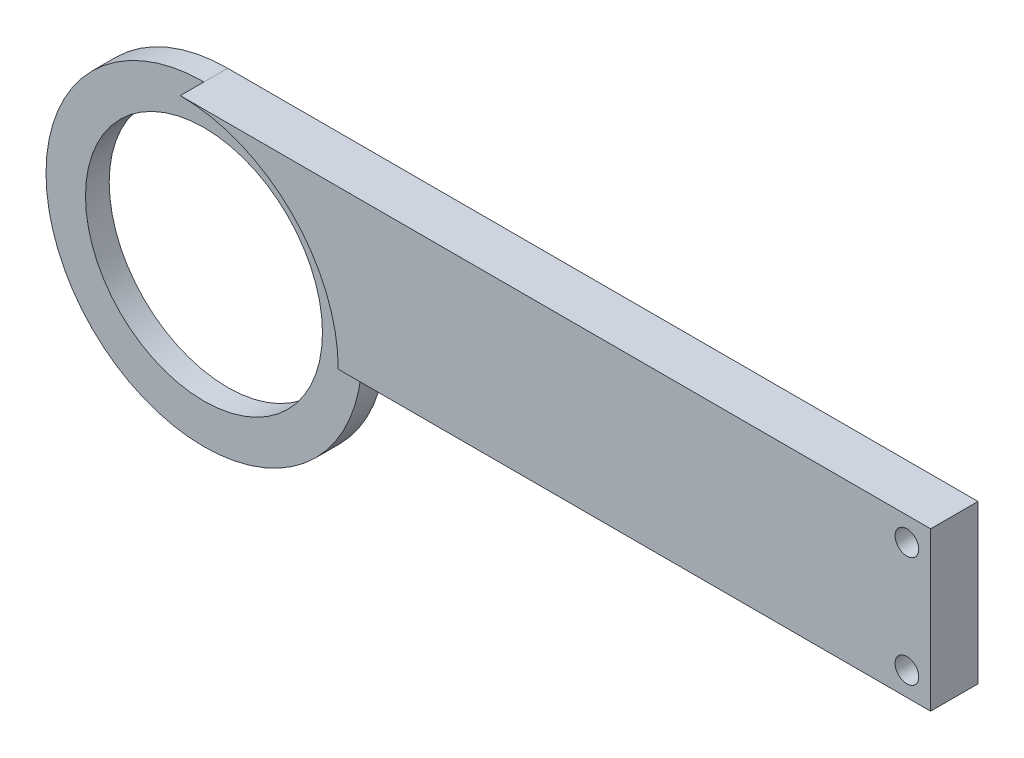
ISO-10303-21;
HEADER;
FILE_DESCRIPTION(('STEP AP214'),'2;1');
FILE_NAME('part.step','',(''),(''),'','','');
FILE_SCHEMA(('AUTOMOTIVE_DESIGN { 1 0 10303 214 1 1 1 1 }'));
ENDSEC;
DATA;
#1=APPLICATION_CONTEXT('core data for automotive mechanical design processes');
#2=APPLICATION_PROTOCOL_DEFINITION('international standard','automotive_design',2000,#1);
#3=PRODUCT_CONTEXT('',#1,'mechanical');
#4=PRODUCT('Part','Part','',(#3));
#5=PRODUCT_RELATED_PRODUCT_CATEGORY('part','',(#4));
#6=PRODUCT_DEFINITION_FORMATION('','',#4);
#7=PRODUCT_DEFINITION_CONTEXT('part definition',#1,'design');
#8=PRODUCT_DEFINITION('design','',#6,#7);
#9=PRODUCT_DEFINITION_SHAPE('','',#8);
#10=(LENGTH_UNIT() NAMED_UNIT(*) SI_UNIT(.MILLI.,.METRE.));
#11=(NAMED_UNIT(*) PLANE_ANGLE_UNIT() SI_UNIT($,.RADIAN.));
#12=(NAMED_UNIT(*) SI_UNIT($,.STERADIAN.) SOLID_ANGLE_UNIT());
#13=UNCERTAINTY_MEASURE_WITH_UNIT(LENGTH_MEASURE(1.E-05),#10,'distance_accuracy_value','');
#14=(GEOMETRIC_REPRESENTATION_CONTEXT(3) GLOBAL_UNCERTAINTY_ASSIGNED_CONTEXT((#13)) GLOBAL_UNIT_ASSIGNED_CONTEXT((#10,
#11,#12)) REPRESENTATION_CONTEXT('',''));
#15=CARTESIAN_POINT('',(0.,0.,0.));
#16=DIRECTION('',(0.,0.,1.));
#17=DIRECTION('',(1.,0.,0.));
#18=AXIS2_PLACEMENT_3D('',#15,#16,#17);
#19=CARTESIAN_POINT('',(-43.211335831246,3.7864077669903,6.));
#20=DIRECTION('',(0.,0.,-1.));
#21=DIRECTION('',(-1.,0.,0.));
#22=AXIS2_PLACEMENT_3D('',#19,#20,#21);
#23=CYLINDRICAL_SURFACE('',#22,20.);
#24=CARTESIAN_POINT('',(-43.211335831246,3.7864077669903,3.));
#25=DIRECTION('',(0.,0.,1.));
#26=DIRECTION('',(1.,0.,0.));
#27=AXIS2_PLACEMENT_3D('',#24,#25,#26);
#28=CIRCLE('',#27,20.);
#29=CARTESIAN_POINT('',(-43.211335831246,23.7864077669903,3.));
#30=VERTEX_POINT('',#29);
#31=CARTESIAN_POINT('',(-23.211335831246,3.7864077669903,3.));
#32=VERTEX_POINT('',#31);
#33=EDGE_CURVE('E127',#30,#32,#28,.T.);
#34=ORIENTED_EDGE('',*,*,#33,.F.);
#35=DIRECTION('',(0.,0.,-1.));
#36=VECTOR('',#35,1.);
#37=CARTESIAN_POINT('',(-43.211335831246,23.7864077669903,6.));
#38=LINE('',#37,#36);
#39=CARTESIAN_POINT('',(-43.211335831246,23.7864077669903,0.));
#40=VERTEX_POINT('',#39);
#41=EDGE_CURVE('E45',#30,#40,#38,.T.);
#42=ORIENTED_EDGE('',*,*,#41,.T.);
#43=CARTESIAN_POINT('',(-43.211335831246,3.7864077669903,0.));
#44=DIRECTION('',(0.,0.,1.));
#45=DIRECTION('',(1.,0.,0.));
#46=AXIS2_PLACEMENT_3D('',#43,#44,#45);
#47=CIRCLE('',#46,20.);
#48=CARTESIAN_POINT('',(-23.211335831246,3.7864077669903,0.));
#49=VERTEX_POINT('',#48);
#50=EDGE_CURVE('E99',#40,#49,#47,.T.);
#51=ORIENTED_EDGE('',*,*,#50,.T.);
#52=DIRECTION('',(0.,0.,-1.));
#53=VECTOR('',#52,1.);
#54=CARTESIAN_POINT('',(-23.211335831246,3.7864077669903,6.));
#55=LINE('',#54,#53);
#56=EDGE_CURVE('E95',#32,#49,#55,.T.);
#57=ORIENTED_EDGE('',*,*,#56,.F.);
#58=EDGE_LOOP('',(#34,#42,#51,#57));
#59=FACE_BOUND('',#58,.T.);
#60=ADVANCED_FACE('F36',(#59),#23,.T.);
#61=CARTESIAN_POINT('',(-43.211335831246,3.7864077669903,6.));
#62=DIRECTION('',(0.,0.,-1.));
#63=DIRECTION('',(-1.,0.,0.));
#64=AXIS2_PLACEMENT_3D('',#61,#62,#63);
#65=CYLINDRICAL_SURFACE('',#64,15.);
#66=CARTESIAN_POINT('',(-43.211335831246,3.7864077669903,0.));
#67=DIRECTION('',(0.,0.,1.));
#68=DIRECTION('',(1.,0.,0.));
#69=AXIS2_PLACEMENT_3D('',#66,#67,#68);
#70=CIRCLE('',#69,15.);
#71=CARTESIAN_POINT('',(-28.211335831246,3.7864077669903,0.));
#72=VERTEX_POINT('',#71);
#73=EDGE_CURVE('E126',#72,#72,#70,.T.);
#74=ORIENTED_EDGE('',*,*,#73,.F.);
#75=EDGE_LOOP('',(#74));
#76=FACE_BOUND('',#75,.T.);
#77=CARTESIAN_POINT('',(-43.211335831246,3.7864077669903,3.));
#78=DIRECTION('',(0.,0.,1.));
#79=DIRECTION('',(1.,0.,0.));
#80=AXIS2_PLACEMENT_3D('',#77,#78,#79);
#81=CIRCLE('',#80,15.);
#82=CARTESIAN_POINT('',(-28.211335831246,3.7864077669903,3.));
#83=VERTEX_POINT('',#82);
#84=EDGE_CURVE('E120',#83,#83,#81,.T.);
#85=ORIENTED_EDGE('',*,*,#84,.T.);
#86=EDGE_LOOP('',(#85));
#87=FACE_BOUND('',#86,.T.);
#88=ADVANCED_FACE('F38',(#76,#87),#65,.F.);
#89=CARTESIAN_POINT('',(0.,23.7864077669903,6.));
#90=DIRECTION('',(0.,-1.,0.));
#91=DIRECTION('',(0.,0.,-1.));
#92=AXIS2_PLACEMENT_3D('',#89,#90,#91);
#93=PLANE('',#92);
#94=DIRECTION('',(-1.,0.,0.));
#95=VECTOR('',#94,1.);
#96=CARTESIAN_POINT('',(0.,23.7864077669903,0.));
#97=LINE('',#96,#95);
#98=CARTESIAN_POINT('',(51.7839068872006,23.7864077669903,0.));
#99=VERTEX_POINT('',#98);
#100=EDGE_CURVE('E112',#99,#40,#97,.T.);
#101=ORIENTED_EDGE('',*,*,#100,.T.);
#102=ORIENTED_EDGE('',*,*,#41,.F.);
#103=CARTESIAN_POINT('',(-43.211335831246,23.7864077669903,6.));
#104=VERTEX_POINT('',#103);
#105=EDGE_CURVE('E11',#104,#30,#38,.T.);
#106=ORIENTED_EDGE('',*,*,#105,.F.);
#107=DIRECTION('',(-1.,0.,0.));
#108=VECTOR('',#107,1.);
#109=CARTESIAN_POINT('',(0.,23.7864077669903,6.));
#110=LINE('',#109,#108);
#111=CARTESIAN_POINT('',(51.7839068872006,23.7864077669903,6.));
#112=VERTEX_POINT('',#111);
#113=EDGE_CURVE('E98',#112,#104,#110,.T.);
#114=ORIENTED_EDGE('',*,*,#113,.F.);
#115=DIRECTION('',(0.,0.,1.));
#116=VECTOR('',#115,1.);
#117=CARTESIAN_POINT('',(51.7839068872006,23.7864077669903,0.));
#118=LINE('',#117,#116);
#119=EDGE_CURVE('E108',#99,#112,#118,.T.);
#120=ORIENTED_EDGE('',*,*,#119,.F.);
#121=EDGE_LOOP('',(#101,#102,#106,#114,#120));
#122=FACE_BOUND('',#121,.T.);
#123=ADVANCED_FACE('F138',(#122),#93,.F.);
#124=CARTESIAN_POINT('',(0.,3.7864077669903,6.));
#125=DIRECTION('',(0.,-1.,0.));
#126=DIRECTION('',(0.,0.,-1.));
#127=AXIS2_PLACEMENT_3D('',#124,#125,#126);
#128=PLANE('',#127);
#129=DIRECTION('',(-1.,0.,0.));
#130=VECTOR('',#129,1.);
#131=CARTESIAN_POINT('',(0.,3.7864077669903,0.));
#132=LINE('',#131,#130);
#133=CARTESIAN_POINT('',(51.7839068872006,3.7864077669903,0.));
#134=VERTEX_POINT('',#133);
#135=EDGE_CURVE('E88',#134,#49,#132,.T.);
#136=ORIENTED_EDGE('',*,*,#135,.F.);
#137=DIRECTION('',(0.,0.,1.));
#138=VECTOR('',#137,1.);
#139=CARTESIAN_POINT('',(51.7839068872006,3.7864077669903,0.));
#140=LINE('',#139,#138);
#141=CARTESIAN_POINT('',(51.7839068872006,3.7864077669903,6.));
#142=VERTEX_POINT('',#141);
#143=EDGE_CURVE('E92',#134,#142,#140,.T.);
#144=ORIENTED_EDGE('',*,*,#143,.T.);
#145=DIRECTION('',(-1.,0.,0.));
#146=VECTOR('',#145,1.);
#147=CARTESIAN_POINT('',(0.,3.7864077669903,6.));
#148=LINE('',#147,#146);
#149=CARTESIAN_POINT('',(-23.211335831246,3.7864077669903,6.));
#150=VERTEX_POINT('',#149);
#151=EDGE_CURVE('E130',#142,#150,#148,.T.);
#152=ORIENTED_EDGE('',*,*,#151,.T.);
#153=EDGE_CURVE('E52',#150,#32,#55,.T.);
#154=ORIENTED_EDGE('',*,*,#153,.T.);
#155=ORIENTED_EDGE('',*,*,#56,.T.);
#156=EDGE_LOOP('',(#136,#144,#152,#154,#155));
#157=FACE_BOUND('',#156,.T.);
#158=ADVANCED_FACE('F90',(#157),#128,.T.);
#159=CARTESIAN_POINT('',(0.,0.,6.));
#160=DIRECTION('',(0.,0.,1.));
#161=DIRECTION('',(1.,0.,0.));
#162=AXIS2_PLACEMENT_3D('',#159,#160,#161);
#163=PLANE('',#162);
#164=CARTESIAN_POINT('',(48.7839068872006,6.7864077669903,6.));
#165=DIRECTION('',(0.,0.,1.));
#166=DIRECTION('',(1.,0.,0.));
#167=AXIS2_PLACEMENT_3D('',#164,#165,#166);
#168=CIRCLE('',#167,1.5);
#169=CARTESIAN_POINT('',(50.2839068872006,6.7864077669903,6.));
#170=VERTEX_POINT('',#169);
#171=EDGE_CURVE('E178',#170,#170,#168,.T.);
#172=ORIENTED_EDGE('',*,*,#171,.F.);
#173=EDGE_LOOP('',(#172));
#174=FACE_BOUND('',#173,.T.);
#175=CARTESIAN_POINT('',(48.7839068872006,20.7864077669903,6.));
#176=DIRECTION('',(0.,0.,1.));
#177=DIRECTION('',(1.,0.,0.));
#178=AXIS2_PLACEMENT_3D('',#175,#176,#177);
#179=CIRCLE('',#178,1.5);
#180=CARTESIAN_POINT('',(50.2839068872006,20.7864077669903,6.));
#181=VERTEX_POINT('',#180);
#182=EDGE_CURVE('E115',#181,#181,#179,.T.);
#183=ORIENTED_EDGE('',*,*,#182,.F.);
#184=EDGE_LOOP('',(#183));
#185=FACE_BOUND('',#184,.T.);
#186=CARTESIAN_POINT('',(-43.211335831246,3.7864077669903,6.));
#187=DIRECTION('',(0.,0.,1.));
#188=DIRECTION('',(1.,0.,0.));
#189=AXIS2_PLACEMENT_3D('',#186,#187,#188);
#190=CIRCLE('',#189,20.);
#191=EDGE_CURVE('E66',#150,#104,#190,.T.);
#192=ORIENTED_EDGE('',*,*,#191,.F.);
#193=ORIENTED_EDGE('',*,*,#151,.F.);
#194=DIRECTION('',(0.,1.,0.));
#195=VECTOR('',#194,1.);
#196=CARTESIAN_POINT('',(51.7839068872006,23.7864077669903,6.));
#197=LINE('',#196,#195);
#198=EDGE_CURVE('E107',#142,#112,#197,.T.);
#199=ORIENTED_EDGE('',*,*,#198,.T.);
#200=ORIENTED_EDGE('',*,*,#113,.T.);
#201=EDGE_LOOP('',(#192,#193,#199,#200));
#202=FACE_BOUND('',#201,.T.);
#203=ADVANCED_FACE('F136',(#174,#185,#202),#163,.T.);
#204=CARTESIAN_POINT('',(0.,0.,0.));
#205=DIRECTION('',(0.,0.,1.));
#206=DIRECTION('',(1.,0.,0.));
#207=AXIS2_PLACEMENT_3D('',#204,#205,#206);
#208=PLANE('',#207);
#209=CARTESIAN_POINT('',(48.7839068872006,6.7864077669903,0.));
#210=DIRECTION('',(0.,0.,-1.));
#211=DIRECTION('',(-1.,0.,0.));
#212=AXIS2_PLACEMENT_3D('',#209,#210,#211);
#213=CIRCLE('',#212,1.5);
#214=CARTESIAN_POINT('',(47.2839068872006,6.7864077669903,0.));
#215=VERTEX_POINT('',#214);
#216=EDGE_CURVE('E181',#215,#215,#213,.T.);
#217=ORIENTED_EDGE('',*,*,#216,.F.);
#218=EDGE_LOOP('',(#217));
#219=FACE_BOUND('',#218,.T.);
#220=CARTESIAN_POINT('',(48.7839068872006,20.7864077669903,0.));
#221=DIRECTION('',(0.,0.,-1.));
#222=DIRECTION('',(-1.,0.,0.));
#223=AXIS2_PLACEMENT_3D('',#220,#221,#222);
#224=CIRCLE('',#223,1.5);
#225=CARTESIAN_POINT('',(47.2839068872006,20.7864077669903,0.));
#226=VERTEX_POINT('',#225);
#227=EDGE_CURVE('E183',#226,#226,#224,.T.);
#228=ORIENTED_EDGE('',*,*,#227,.F.);
#229=EDGE_LOOP('',(#228));
#230=FACE_BOUND('',#229,.T.);
#231=ORIENTED_EDGE('',*,*,#73,.T.);
#232=EDGE_LOOP('',(#231));
#233=FACE_BOUND('',#232,.T.);
#234=ORIENTED_EDGE('',*,*,#100,.F.);
#235=DIRECTION('',(0.,1.,0.));
#236=VECTOR('',#235,1.);
#237=CARTESIAN_POINT('',(51.7839068872006,23.7864077669903,0.));
#238=LINE('',#237,#236);
#239=EDGE_CURVE('E105',#134,#99,#238,.T.);
#240=ORIENTED_EDGE('',*,*,#239,.F.);
#241=ORIENTED_EDGE('',*,*,#135,.T.);
#242=ORIENTED_EDGE('',*,*,#50,.F.);
#243=EDGE_LOOP('',(#234,#240,#241,#242));
#244=FACE_BOUND('',#243,.T.);
#245=ADVANCED_FACE('F110',(#219,#230,#233,#244),#208,.F.);
#246=CARTESIAN_POINT('',(-43.211335831246,3.7864077669903,3.));
#247=DIRECTION('',(0.,0.,1.));
#248=DIRECTION('',(1.,0.,0.));
#249=AXIS2_PLACEMENT_3D('',#246,#247,#248);
#250=CYLINDRICAL_SURFACE('',#249,20.);
#251=EDGE_CURVE('E124',#32,#30,#28,.T.);
#252=ORIENTED_EDGE('',*,*,#251,.F.);
#253=ORIENTED_EDGE('',*,*,#153,.F.);
#254=ORIENTED_EDGE('',*,*,#191,.T.);
#255=ORIENTED_EDGE('',*,*,#105,.T.);
#256=EDGE_LOOP('',(#252,#253,#254,#255));
#257=FACE_BOUND('',#256,.T.);
#258=ADVANCED_FACE('F153',(#257),#250,.F.);
#259=CARTESIAN_POINT('',(-43.211335831246,3.7864077669903,3.));
#260=DIRECTION('',(0.,0.,1.));
#261=DIRECTION('',(1.,0.,0.));
#262=AXIS2_PLACEMENT_3D('',#259,#260,#261);
#263=PLANE('',#262);
#264=ORIENTED_EDGE('',*,*,#84,.F.);
#265=EDGE_LOOP('',(#264));
#266=FACE_BOUND('',#265,.T.);
#267=ORIENTED_EDGE('',*,*,#251,.T.);
#268=ORIENTED_EDGE('',*,*,#33,.T.);
#269=EDGE_LOOP('',(#267,#268));
#270=FACE_BOUND('',#269,.T.);
#271=ADVANCED_FACE('F160',(#266,#270),#263,.T.);
#272=CARTESIAN_POINT('',(51.7839068872006,23.7864077669903,0.));
#273=DIRECTION('',(1.,0.,0.));
#274=DIRECTION('',(0.,0.,-1.));
#275=AXIS2_PLACEMENT_3D('',#272,#273,#274);
#276=PLANE('',#275);
#277=ORIENTED_EDGE('',*,*,#198,.F.);
#278=ORIENTED_EDGE('',*,*,#143,.F.);
#279=ORIENTED_EDGE('',*,*,#239,.T.);
#280=ORIENTED_EDGE('',*,*,#119,.T.);
#281=EDGE_LOOP('',(#277,#278,#279,#280));
#282=FACE_BOUND('',#281,.T.);
#283=ADVANCED_FACE('F103',(#282),#276,.T.);
#284=CARTESIAN_POINT('',(48.7839068872006,20.7864077669903,10.));
#285=DIRECTION('',(0.,0.,-1.));
#286=DIRECTION('',(-1.,0.,0.));
#287=AXIS2_PLACEMENT_3D('',#284,#285,#286);
#288=CYLINDRICAL_SURFACE('',#287,1.5);
#289=ORIENTED_EDGE('',*,*,#182,.T.);
#290=EDGE_LOOP('',(#289));
#291=FACE_BOUND('',#290,.T.);
#292=ORIENTED_EDGE('',*,*,#227,.T.);
#293=EDGE_LOOP('',(#292));
#294=FACE_BOUND('',#293,.T.);
#295=ADVANCED_FACE('F166',(#291,#294),#288,.F.);
#296=CARTESIAN_POINT('',(48.7839068872006,6.7864077669903,10.));
#297=DIRECTION('',(0.,0.,-1.));
#298=DIRECTION('',(-1.,0.,0.));
#299=AXIS2_PLACEMENT_3D('',#296,#297,#298);
#300=CYLINDRICAL_SURFACE('',#299,1.5);
#301=ORIENTED_EDGE('',*,*,#171,.T.);
#302=EDGE_LOOP('',(#301));
#303=FACE_BOUND('',#302,.T.);
#304=ORIENTED_EDGE('',*,*,#216,.T.);
#305=EDGE_LOOP('',(#304));
#306=FACE_BOUND('',#305,.T.);
#307=ADVANCED_FACE('F169',(#303,#306),#300,.F.);
#308=CLOSED_SHELL('',(#60,#88,#123,#158,#203,#245,#258,#271,#283,#295,#307));
#309=MANIFOLD_SOLID_BREP('B2',#308);
#310=ADVANCED_BREP_SHAPE_REPRESENTATION('',(#18,#309),#14);
#311=SHAPE_DEFINITION_REPRESENTATION(#9,#310);
ENDSEC;
END-ISO-10303-21;
